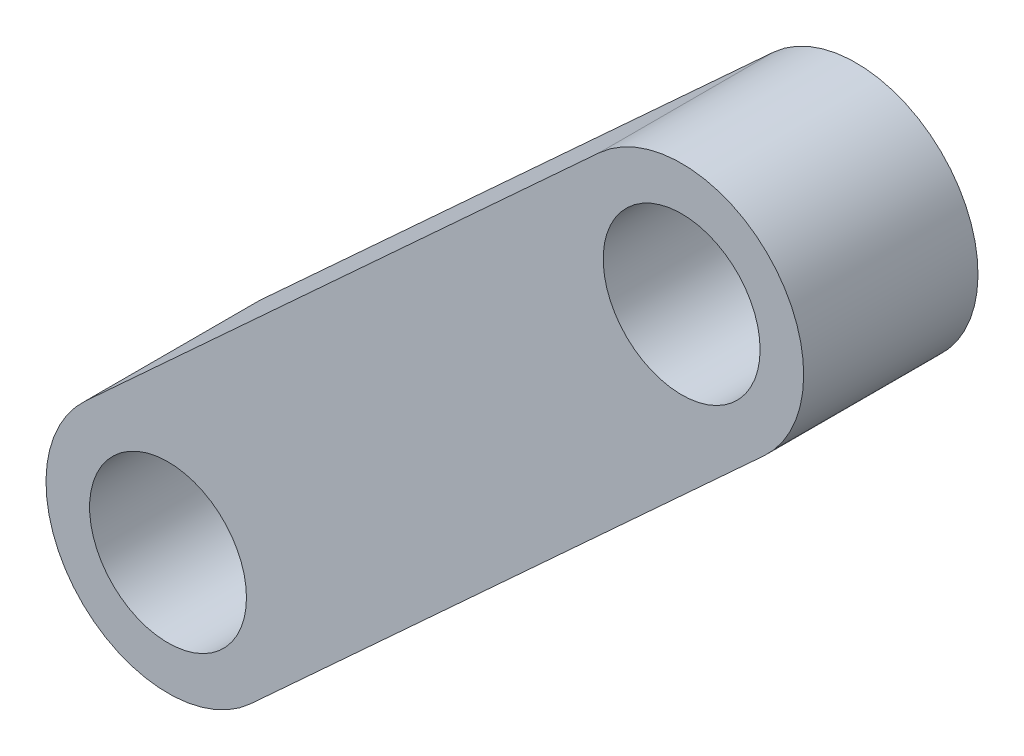
ISO-10303-21;
HEADER;
FILE_DESCRIPTION(('STEP AP214'),'2;1');
FILE_NAME('part.step','',(''),(''),'','','');
FILE_SCHEMA(('AUTOMOTIVE_DESIGN { 1 0 10303 214 1 1 1 1 }'));
ENDSEC;
DATA;
#1=APPLICATION_CONTEXT('core data for automotive mechanical design processes');
#2=APPLICATION_PROTOCOL_DEFINITION('international standard','automotive_design',2000,#1);
#3=PRODUCT_CONTEXT('',#1,'mechanical');
#4=PRODUCT('Part','Part','',(#3));
#5=PRODUCT_RELATED_PRODUCT_CATEGORY('part','',(#4));
#6=PRODUCT_DEFINITION_FORMATION('','',#4);
#7=PRODUCT_DEFINITION_CONTEXT('part definition',#1,'design');
#8=PRODUCT_DEFINITION('design','',#6,#7);
#9=PRODUCT_DEFINITION_SHAPE('','',#8);
#10=(LENGTH_UNIT() NAMED_UNIT(*) SI_UNIT(.MILLI.,.METRE.));
#11=(NAMED_UNIT(*) PLANE_ANGLE_UNIT() SI_UNIT($,.RADIAN.));
#12=(NAMED_UNIT(*) SI_UNIT($,.STERADIAN.) SOLID_ANGLE_UNIT());
#13=UNCERTAINTY_MEASURE_WITH_UNIT(LENGTH_MEASURE(1.E-05),#10,'distance_accuracy_value','');
#14=(GEOMETRIC_REPRESENTATION_CONTEXT(3) GLOBAL_UNCERTAINTY_ASSIGNED_CONTEXT((#13)) GLOBAL_UNIT_ASSIGNED_CONTEXT((#10,
#11,#12)) REPRESENTATION_CONTEXT('',''));
#15=CARTESIAN_POINT('',(0.,0.,0.));
#16=DIRECTION('',(0.,0.,1.));
#17=DIRECTION('',(1.,0.,0.));
#18=AXIS2_PLACEMENT_3D('',#15,#16,#17);
#19=CARTESIAN_POINT('',(0.,0.,100.));
#20=DIRECTION('',(0.,0.,1.));
#21=DIRECTION('',(1.,0.,0.));
#22=AXIS2_PLACEMENT_3D('',#19,#20,#21);
#23=PLANE('',#22);
#24=CARTESIAN_POINT('',(0.,0.,100.));
#25=DIRECTION('',(0.,0.,1.));
#26=DIRECTION('',(1.,0.,0.));
#27=AXIS2_PLACEMENT_3D('',#24,#25,#26);
#28=CIRCLE('',#27,45.);
#29=CARTESIAN_POINT('',(45.,0.,100.));
#30=VERTEX_POINT('',#29);
#31=EDGE_CURVE('E116',#30,#30,#28,.T.);
#32=ORIENTED_EDGE('',*,*,#31,.F.);
#33=EDGE_LOOP('',(#32));
#34=FACE_BOUND('',#33,.T.);
#35=CARTESIAN_POINT('',(0.,0.,100.));
#36=DIRECTION('',(0.,0.,1.));
#37=DIRECTION('',(1.,0.,0.));
#38=AXIS2_PLACEMENT_3D('',#35,#36,#37);
#39=CIRCLE('',#38,70.);
#40=CARTESIAN_POINT('',(-47.3470648552437,51.5582723681985,100.));
#41=VERTEX_POINT('',#40);
#42=CARTESIAN_POINT('',(47.3470648552437,-51.5582723681985,100.));
#43=VERTEX_POINT('',#42);
#44=EDGE_CURVE('E96',#41,#43,#39,.T.);
#45=ORIENTED_EDGE('',*,*,#44,.T.);
#46=DIRECTION('',(0.736546748117122,0.676386640789196,0.));
#47=VECTOR('',#46,1.);
#48=CARTESIAN_POINT('',(47.3470648552437,-51.5582723681985,100.));
#49=LINE('',#48,#47);
#50=CARTESIAN_POINT('',(341.965764102092,218.99638394748,100.));
#51=VERTEX_POINT('',#50);
#52=EDGE_CURVE('E91',#43,#51,#49,.T.);
#53=ORIENTED_EDGE('',*,*,#52,.T.);
#54=CARTESIAN_POINT('',(294.618699246849,270.554656315678,100.));
#55=DIRECTION('',(0.,0.,1.));
#56=DIRECTION('',(1.,0.,0.));
#57=AXIS2_PLACEMENT_3D('',#54,#55,#56);
#58=CIRCLE('',#57,70.0000000000001);
#59=CARTESIAN_POINT('',(247.271634391605,322.112928683877,100.));
#60=VERTEX_POINT('',#59);
#61=EDGE_CURVE('E94',#51,#60,#58,.T.);
#62=ORIENTED_EDGE('',*,*,#61,.T.);
#63=DIRECTION('',(-0.736546748117122,-0.676386640789196,0.));
#64=VECTOR('',#63,1.);
#65=CARTESIAN_POINT('',(-47.3470648552437,51.5582723681985,100.));
#66=LINE('',#65,#64);
#67=EDGE_CURVE('E61',#60,#41,#66,.T.);
#68=ORIENTED_EDGE('',*,*,#67,.T.);
#69=EDGE_LOOP('',(#45,#53,#62,#68));
#70=FACE_BOUND('',#69,.T.);
#71=CARTESIAN_POINT('',(294.618699246849,270.554656315678,100.));
#72=DIRECTION('',(0.,0.,1.));
#73=DIRECTION('',(1.,0.,0.));
#74=AXIS2_PLACEMENT_3D('',#71,#72,#73);
#75=CIRCLE('',#74,45.);
#76=CARTESIAN_POINT('',(339.618699246849,270.554656315678,100.));
#77=VERTEX_POINT('',#76);
#78=EDGE_CURVE('E138',#77,#77,#75,.T.);
#79=ORIENTED_EDGE('',*,*,#78,.F.);
#80=EDGE_LOOP('',(#79));
#81=FACE_BOUND('',#80,.T.);
#82=ADVANCED_FACE('F43',(#34,#70,#81),#23,.T.);
#83=CARTESIAN_POINT('',(0.,0.,0.));
#84=DIRECTION('',(0.,0.,1.));
#85=DIRECTION('',(1.,0.,0.));
#86=AXIS2_PLACEMENT_3D('',#83,#84,#85);
#87=PLANE('',#86);
#88=CARTESIAN_POINT('',(0.,0.,0.));
#89=DIRECTION('',(0.,0.,1.));
#90=DIRECTION('',(1.,0.,0.));
#91=AXIS2_PLACEMENT_3D('',#88,#89,#90);
#92=CIRCLE('',#91,70.);
#93=CARTESIAN_POINT('',(-47.3470648552437,51.5582723681985,0.));
#94=VERTEX_POINT('',#93);
#95=CARTESIAN_POINT('',(47.3470648552437,-51.5582723681985,0.));
#96=VERTEX_POINT('',#95);
#97=EDGE_CURVE('E112',#94,#96,#92,.T.);
#98=ORIENTED_EDGE('',*,*,#97,.F.);
#99=DIRECTION('',(-0.736546748117122,-0.676386640789196,0.));
#100=VECTOR('',#99,1.);
#101=CARTESIAN_POINT('',(-47.3470648552437,51.5582723681985,0.));
#102=LINE('',#101,#100);
#103=CARTESIAN_POINT('',(247.271634391605,322.112928683877,0.));
#104=VERTEX_POINT('',#103);
#105=EDGE_CURVE('E84',#104,#94,#102,.T.);
#106=ORIENTED_EDGE('',*,*,#105,.F.);
#107=CARTESIAN_POINT('',(294.618699246849,270.554656315678,0.));
#108=DIRECTION('',(0.,0.,1.));
#109=DIRECTION('',(1.,0.,0.));
#110=AXIS2_PLACEMENT_3D('',#107,#108,#109);
#111=CIRCLE('',#110,70.0000000000001);
#112=CARTESIAN_POINT('',(341.965764102092,218.99638394748,0.));
#113=VERTEX_POINT('',#112);
#114=EDGE_CURVE('E78',#113,#104,#111,.T.);
#115=ORIENTED_EDGE('',*,*,#114,.F.);
#116=DIRECTION('',(0.736546748117122,0.676386640789196,0.));
#117=VECTOR('',#116,1.);
#118=CARTESIAN_POINT('',(47.3470648552437,-51.5582723681985,0.));
#119=LINE('',#118,#117);
#120=EDGE_CURVE('E101',#96,#113,#119,.T.);
#121=ORIENTED_EDGE('',*,*,#120,.F.);
#122=EDGE_LOOP('',(#98,#106,#115,#121));
#123=FACE_BOUND('',#122,.T.);
#124=CARTESIAN_POINT('',(0.,0.,0.));
#125=DIRECTION('',(0.,0.,1.));
#126=DIRECTION('',(1.,0.,0.));
#127=AXIS2_PLACEMENT_3D('',#124,#125,#126);
#128=CIRCLE('',#127,45.);
#129=CARTESIAN_POINT('',(45.,0.,0.));
#130=VERTEX_POINT('',#129);
#131=EDGE_CURVE('E134',#130,#130,#128,.T.);
#132=ORIENTED_EDGE('',*,*,#131,.T.);
#133=EDGE_LOOP('',(#132));
#134=FACE_BOUND('',#133,.T.);
#135=CARTESIAN_POINT('',(294.618699246849,270.554656315678,0.));
#136=DIRECTION('',(0.,0.,1.));
#137=DIRECTION('',(1.,0.,0.));
#138=AXIS2_PLACEMENT_3D('',#135,#136,#137);
#139=CIRCLE('',#138,45.);
#140=CARTESIAN_POINT('',(339.618699246849,270.554656315678,0.));
#141=VERTEX_POINT('',#140);
#142=EDGE_CURVE('E142',#141,#141,#139,.T.);
#143=ORIENTED_EDGE('',*,*,#142,.T.);
#144=EDGE_LOOP('',(#143));
#145=FACE_BOUND('',#144,.T.);
#146=ADVANCED_FACE('F129',(#123,#134,#145),#87,.F.);
#147=CARTESIAN_POINT('',(0.,0.,100.));
#148=DIRECTION('',(0.,0.,-1.));
#149=DIRECTION('',(-1.,0.,0.));
#150=AXIS2_PLACEMENT_3D('',#147,#148,#149);
#151=CYLINDRICAL_SURFACE('',#150,70.);
#152=ORIENTED_EDGE('',*,*,#97,.T.);
#153=DIRECTION('',(0.,0.,-1.));
#154=VECTOR('',#153,1.);
#155=CARTESIAN_POINT('',(47.3470648552437,-51.5582723681985,100.));
#156=LINE('',#155,#154);
#157=EDGE_CURVE('E11',#43,#96,#156,.T.);
#158=ORIENTED_EDGE('',*,*,#157,.F.);
#159=ORIENTED_EDGE('',*,*,#44,.F.);
#160=DIRECTION('',(0.,0.,-1.));
#161=VECTOR('',#160,1.);
#162=CARTESIAN_POINT('',(-47.3470648552437,51.5582723681985,100.));
#163=LINE('',#162,#161);
#164=EDGE_CURVE('E108',#41,#94,#163,.T.);
#165=ORIENTED_EDGE('',*,*,#164,.T.);
#166=EDGE_LOOP('',(#152,#158,#159,#165));
#167=FACE_BOUND('',#166,.T.);
#168=ADVANCED_FACE('F45',(#167),#151,.T.);
#169=CARTESIAN_POINT('',(47.3470648552437,-51.5582723681985,100.));
#170=DIRECTION('',(-0.676386640789196,0.736546748117122,0.));
#171=DIRECTION('',(-0.736546748117122,-0.676386640789196,0.));
#172=AXIS2_PLACEMENT_3D('',#169,#170,#171);
#173=PLANE('',#172);
#174=ORIENTED_EDGE('',*,*,#120,.T.);
#175=DIRECTION('',(0.,0.,-1.));
#176=VECTOR('',#175,1.);
#177=CARTESIAN_POINT('',(341.965764102092,218.99638394748,100.));
#178=LINE('',#177,#176);
#179=EDGE_CURVE('E53',#51,#113,#178,.T.);
#180=ORIENTED_EDGE('',*,*,#179,.F.);
#181=ORIENTED_EDGE('',*,*,#52,.F.);
#182=ORIENTED_EDGE('',*,*,#157,.T.);
#183=EDGE_LOOP('',(#174,#180,#181,#182));
#184=FACE_BOUND('',#183,.T.);
#185=ADVANCED_FACE('F100',(#184),#173,.F.);
#186=CARTESIAN_POINT('',(294.618699246849,270.554656315678,100.));
#187=DIRECTION('',(0.,0.,-1.));
#188=DIRECTION('',(-1.,0.,0.));
#189=AXIS2_PLACEMENT_3D('',#186,#187,#188);
#190=CYLINDRICAL_SURFACE('',#189,70.0000000000001);
#191=ORIENTED_EDGE('',*,*,#114,.T.);
#192=DIRECTION('',(0.,0.,-1.));
#193=VECTOR('',#192,1.);
#194=CARTESIAN_POINT('',(247.271634391605,322.112928683877,100.));
#195=LINE('',#194,#193);
#196=EDGE_CURVE('E103',#60,#104,#195,.T.);
#197=ORIENTED_EDGE('',*,*,#196,.F.);
#198=ORIENTED_EDGE('',*,*,#61,.F.);
#199=ORIENTED_EDGE('',*,*,#179,.T.);
#200=EDGE_LOOP('',(#191,#197,#198,#199));
#201=FACE_BOUND('',#200,.T.);
#202=ADVANCED_FACE('F104',(#201),#190,.T.);
#203=CARTESIAN_POINT('',(-47.3470648552437,51.5582723681985,100.));
#204=DIRECTION('',(0.676386640789196,-0.736546748117122,0.));
#205=DIRECTION('',(0.736546748117122,0.676386640789196,0.));
#206=AXIS2_PLACEMENT_3D('',#203,#204,#205);
#207=PLANE('',#206);
#208=ORIENTED_EDGE('',*,*,#105,.T.);
#209=ORIENTED_EDGE('',*,*,#164,.F.);
#210=ORIENTED_EDGE('',*,*,#67,.F.);
#211=ORIENTED_EDGE('',*,*,#196,.T.);
#212=EDGE_LOOP('',(#208,#209,#210,#211));
#213=FACE_BOUND('',#212,.T.);
#214=ADVANCED_FACE('F126',(#213),#207,.F.);
#215=CARTESIAN_POINT('',(0.,0.,100.));
#216=DIRECTION('',(0.,0.,-1.));
#217=DIRECTION('',(-1.,0.,0.));
#218=AXIS2_PLACEMENT_3D('',#215,#216,#217);
#219=CYLINDRICAL_SURFACE('',#218,45.);
#220=ORIENTED_EDGE('',*,*,#31,.T.);
#221=EDGE_LOOP('',(#220));
#222=FACE_BOUND('',#221,.T.);
#223=ORIENTED_EDGE('',*,*,#131,.F.);
#224=EDGE_LOOP('',(#223));
#225=FACE_BOUND('',#224,.T.);
#226=ADVANCED_FACE('F161',(#222,#225),#219,.F.);
#227=CARTESIAN_POINT('',(294.618699246849,270.554656315678,100.));
#228=DIRECTION('',(0.,0.,-1.));
#229=DIRECTION('',(-1.,0.,0.));
#230=AXIS2_PLACEMENT_3D('',#227,#228,#229);
#231=CYLINDRICAL_SURFACE('',#230,45.);
#232=ORIENTED_EDGE('',*,*,#78,.T.);
#233=EDGE_LOOP('',(#232));
#234=FACE_BOUND('',#233,.T.);
#235=ORIENTED_EDGE('',*,*,#142,.F.);
#236=EDGE_LOOP('',(#235));
#237=FACE_BOUND('',#236,.T.);
#238=ADVANCED_FACE('F150',(#234,#237),#231,.F.);
#239=CLOSED_SHELL('',(#82,#146,#168,#185,#202,#214,#226,#238));
#240=MANIFOLD_SOLID_BREP('B2',#239);
#241=ADVANCED_BREP_SHAPE_REPRESENTATION('',(#18,#240),#14);
#242=SHAPE_DEFINITION_REPRESENTATION(#9,#241);
ENDSEC;
END-ISO-10303-21;
